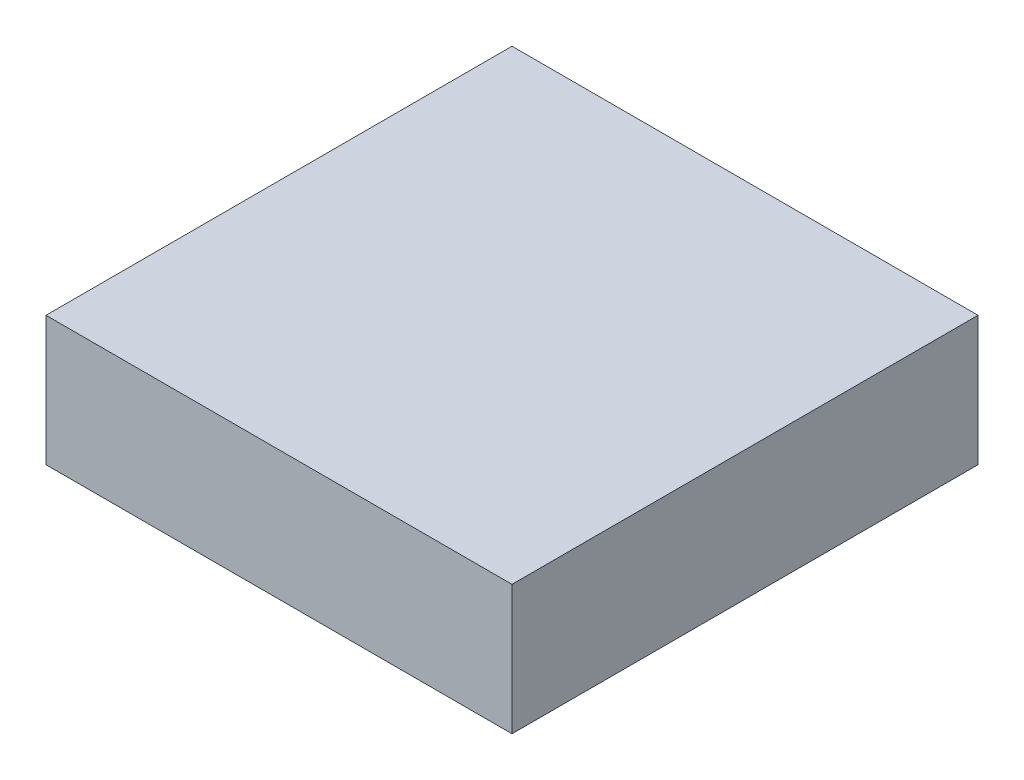
ISO-10303-21;
HEADER;
FILE_DESCRIPTION(('STEP AP214'),'2;1');
FILE_NAME('part.step','',(''),(''),'','','');
FILE_SCHEMA(('AUTOMOTIVE_DESIGN { 1 0 10303 214 1 1 1 1 }'));
ENDSEC;
DATA;
#1=APPLICATION_CONTEXT('core data for automotive mechanical design processes');
#2=APPLICATION_PROTOCOL_DEFINITION('international standard','automotive_design',2000,#1);
#3=PRODUCT_CONTEXT('',#1,'mechanical');
#4=PRODUCT('Part','Part','',(#3));
#5=PRODUCT_RELATED_PRODUCT_CATEGORY('part','',(#4));
#6=PRODUCT_DEFINITION_FORMATION('','',#4);
#7=PRODUCT_DEFINITION_CONTEXT('part definition',#1,'design');
#8=PRODUCT_DEFINITION('design','',#6,#7);
#9=PRODUCT_DEFINITION_SHAPE('','',#8);
#10=(LENGTH_UNIT() NAMED_UNIT(*) SI_UNIT(.MILLI.,.METRE.));
#11=(NAMED_UNIT(*) PLANE_ANGLE_UNIT() SI_UNIT($,.RADIAN.));
#12=(NAMED_UNIT(*) SI_UNIT($,.STERADIAN.) SOLID_ANGLE_UNIT());
#13=UNCERTAINTY_MEASURE_WITH_UNIT(LENGTH_MEASURE(1.E-05),#10,'distance_accuracy_value','');
#14=(GEOMETRIC_REPRESENTATION_CONTEXT(3) GLOBAL_UNCERTAINTY_ASSIGNED_CONTEXT((#13)) GLOBAL_UNIT_ASSIGNED_CONTEXT((#10,
#11,#12)) REPRESENTATION_CONTEXT('',''));
#15=CARTESIAN_POINT('',(0.,0.,0.));
#16=DIRECTION('',(0.,0.,1.));
#17=DIRECTION('',(1.,0.,0.));
#18=AXIS2_PLACEMENT_3D('',#15,#16,#17);
#19=CARTESIAN_POINT('',(-18.,10.,18.));
#20=DIRECTION('',(1.,0.,0.));
#21=DIRECTION('',(0.,0.,-1.));
#22=AXIS2_PLACEMENT_3D('',#19,#20,#21);
#23=PLANE('',#22);
#24=DIRECTION('',(0.,0.,1.));
#25=VECTOR('',#24,1.);
#26=CARTESIAN_POINT('',(-18.,0.,18.));
#27=LINE('',#26,#25);
#28=CARTESIAN_POINT('',(-18.,0.,-18.));
#29=VERTEX_POINT('',#28);
#30=CARTESIAN_POINT('',(-18.,0.,18.));
#31=VERTEX_POINT('',#30);
#32=EDGE_CURVE('E98',#29,#31,#27,.T.);
#33=ORIENTED_EDGE('',*,*,#32,.T.);
#34=DIRECTION('',(0.,-1.,0.));
#35=VECTOR('',#34,1.);
#36=CARTESIAN_POINT('',(-18.,10.,18.));
#37=LINE('',#36,#35);
#38=CARTESIAN_POINT('',(-18.,10.,18.));
#39=VERTEX_POINT('',#38);
#40=EDGE_CURVE('E11',#39,#31,#37,.T.);
#41=ORIENTED_EDGE('',*,*,#40,.F.);
#42=DIRECTION('',(0.,0.,1.));
#43=VECTOR('',#42,1.);
#44=CARTESIAN_POINT('',(-18.,10.,18.));
#45=LINE('',#44,#43);
#46=CARTESIAN_POINT('',(-18.,10.,-18.));
#47=VERTEX_POINT('',#46);
#48=EDGE_CURVE('E86',#47,#39,#45,.T.);
#49=ORIENTED_EDGE('',*,*,#48,.F.);
#50=DIRECTION('',(0.,-1.,0.));
#51=VECTOR('',#50,1.);
#52=CARTESIAN_POINT('',(-18.,10.,-18.));
#53=LINE('',#52,#51);
#54=EDGE_CURVE('E94',#47,#29,#53,.T.);
#55=ORIENTED_EDGE('',*,*,#54,.T.);
#56=EDGE_LOOP('',(#33,#41,#49,#55));
#57=FACE_BOUND('',#56,.T.);
#58=ADVANCED_FACE('F35',(#57),#23,.F.);
#59=CARTESIAN_POINT('',(-18.,10.,18.));
#60=DIRECTION('',(0.,0.,-1.));
#61=DIRECTION('',(-1.,0.,0.));
#62=AXIS2_PLACEMENT_3D('',#59,#60,#61);
#63=PLANE('',#62);
#64=DIRECTION('',(1.,0.,0.));
#65=VECTOR('',#64,1.);
#66=CARTESIAN_POINT('',(-18.,0.,18.));
#67=LINE('',#66,#65);
#68=CARTESIAN_POINT('',(18.,0.,18.));
#69=VERTEX_POINT('',#68);
#70=EDGE_CURVE('E90',#31,#69,#67,.T.);
#71=ORIENTED_EDGE('',*,*,#70,.T.);
#72=DIRECTION('',(0.,-1.,0.));
#73=VECTOR('',#72,1.);
#74=CARTESIAN_POINT('',(18.,10.,18.));
#75=LINE('',#74,#73);
#76=CARTESIAN_POINT('',(18.,10.,18.));
#77=VERTEX_POINT('',#76);
#78=EDGE_CURVE('E43',#77,#69,#75,.T.);
#79=ORIENTED_EDGE('',*,*,#78,.F.);
#80=DIRECTION('',(1.,0.,0.));
#81=VECTOR('',#80,1.);
#82=CARTESIAN_POINT('',(-18.,10.,18.));
#83=LINE('',#82,#81);
#84=EDGE_CURVE('E81',#39,#77,#83,.T.);
#85=ORIENTED_EDGE('',*,*,#84,.F.);
#86=ORIENTED_EDGE('',*,*,#40,.T.);
#87=EDGE_LOOP('',(#71,#79,#85,#86));
#88=FACE_BOUND('',#87,.T.);
#89=ADVANCED_FACE('F89',(#88),#63,.F.);
#90=CARTESIAN_POINT('',(18.,10.,18.));
#91=DIRECTION('',(-1.,0.,0.));
#92=DIRECTION('',(0.,0.,1.));
#93=AXIS2_PLACEMENT_3D('',#90,#91,#92);
#94=PLANE('',#93);
#95=DIRECTION('',(0.,0.,-1.));
#96=VECTOR('',#95,1.);
#97=CARTESIAN_POINT('',(18.,0.,18.));
#98=LINE('',#97,#96);
#99=CARTESIAN_POINT('',(18.,0.,-18.));
#100=VERTEX_POINT('',#99);
#101=EDGE_CURVE('E68',#69,#100,#98,.T.);
#102=ORIENTED_EDGE('',*,*,#101,.T.);
#103=DIRECTION('',(0.,-1.,0.));
#104=VECTOR('',#103,1.);
#105=CARTESIAN_POINT('',(18.,10.,-18.));
#106=LINE('',#105,#104);
#107=CARTESIAN_POINT('',(18.,10.,-18.));
#108=VERTEX_POINT('',#107);
#109=EDGE_CURVE('E91',#108,#100,#106,.T.);
#110=ORIENTED_EDGE('',*,*,#109,.F.);
#111=DIRECTION('',(0.,0.,-1.));
#112=VECTOR('',#111,1.);
#113=CARTESIAN_POINT('',(18.,10.,18.));
#114=LINE('',#113,#112);
#115=EDGE_CURVE('E84',#77,#108,#114,.T.);
#116=ORIENTED_EDGE('',*,*,#115,.F.);
#117=ORIENTED_EDGE('',*,*,#78,.T.);
#118=EDGE_LOOP('',(#102,#110,#116,#117));
#119=FACE_BOUND('',#118,.T.);
#120=ADVANCED_FACE('F92',(#119),#94,.F.);
#121=CARTESIAN_POINT('',(-18.,10.,-18.));
#122=DIRECTION('',(0.,0.,1.));
#123=DIRECTION('',(1.,0.,0.));
#124=AXIS2_PLACEMENT_3D('',#121,#122,#123);
#125=PLANE('',#124);
#126=DIRECTION('',(-1.,0.,0.));
#127=VECTOR('',#126,1.);
#128=CARTESIAN_POINT('',(-18.,0.,-18.));
#129=LINE('',#128,#127);
#130=EDGE_CURVE('E74',#100,#29,#129,.T.);
#131=ORIENTED_EDGE('',*,*,#130,.T.);
#132=ORIENTED_EDGE('',*,*,#54,.F.);
#133=DIRECTION('',(-1.,0.,0.));
#134=VECTOR('',#133,1.);
#135=CARTESIAN_POINT('',(-18.,10.,-18.));
#136=LINE('',#135,#134);
#137=EDGE_CURVE('E51',#108,#47,#136,.T.);
#138=ORIENTED_EDGE('',*,*,#137,.F.);
#139=ORIENTED_EDGE('',*,*,#109,.T.);
#140=EDGE_LOOP('',(#131,#132,#138,#139));
#141=FACE_BOUND('',#140,.T.);
#142=ADVANCED_FACE('F105',(#141),#125,.F.);
#143=CARTESIAN_POINT('',(0.,10.,0.));
#144=DIRECTION('',(0.,-1.,0.));
#145=DIRECTION('',(0.,0.,-1.));
#146=AXIS2_PLACEMENT_3D('',#143,#144,#145);
#147=PLANE('',#146);
#148=ORIENTED_EDGE('',*,*,#48,.T.);
#149=ORIENTED_EDGE('',*,*,#84,.T.);
#150=ORIENTED_EDGE('',*,*,#115,.T.);
#151=ORIENTED_EDGE('',*,*,#137,.T.);
#152=EDGE_LOOP('',(#148,#149,#150,#151));
#153=FACE_BOUND('',#152,.T.);
#154=ADVANCED_FACE('F82',(#153),#147,.F.);
#155=CARTESIAN_POINT('',(0.,0.,0.));
#156=DIRECTION('',(0.,-1.,0.));
#157=DIRECTION('',(0.,0.,-1.));
#158=AXIS2_PLACEMENT_3D('',#155,#156,#157);
#159=PLANE('',#158);
#160=ORIENTED_EDGE('',*,*,#32,.F.);
#161=ORIENTED_EDGE('',*,*,#130,.F.);
#162=ORIENTED_EDGE('',*,*,#101,.F.);
#163=ORIENTED_EDGE('',*,*,#70,.F.);
#164=EDGE_LOOP('',(#160,#161,#162,#163));
#165=FACE_BOUND('',#164,.T.);
#166=ADVANCED_FACE('F108',(#165),#159,.T.);
#167=CLOSED_SHELL('',(#58,#89,#120,#142,#154,#166));
#168=MANIFOLD_SOLID_BREP('B2',#167);
#169=ADVANCED_BREP_SHAPE_REPRESENTATION('',(#18,#168),#14);
#170=SHAPE_DEFINITION_REPRESENTATION(#9,#169);
ENDSEC;
END-ISO-10303-21;
